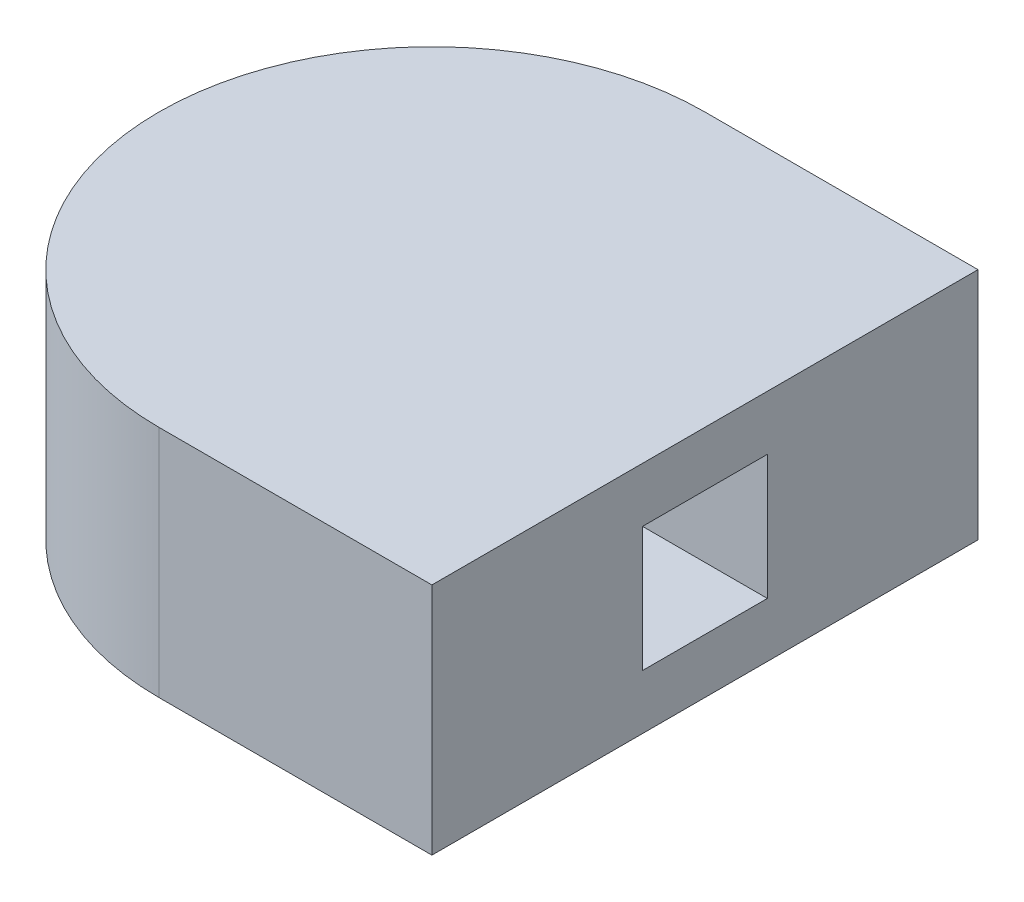
ISO-10303-21;
HEADER;
FILE_DESCRIPTION(('STEP AP214'),'2;1');
FILE_NAME('part.step','',(''),(''),'','','');
FILE_SCHEMA(('AUTOMOTIVE_DESIGN { 1 0 10303 214 1 1 1 1 }'));
ENDSEC;
DATA;
#1=APPLICATION_CONTEXT('core data for automotive mechanical design processes');
#2=APPLICATION_PROTOCOL_DEFINITION('international standard','automotive_design',2000,#1);
#3=PRODUCT_CONTEXT('',#1,'mechanical');
#4=PRODUCT('Part','Part','',(#3));
#5=PRODUCT_RELATED_PRODUCT_CATEGORY('part','',(#4));
#6=PRODUCT_DEFINITION_FORMATION('','',#4);
#7=PRODUCT_DEFINITION_CONTEXT('part definition',#1,'design');
#8=PRODUCT_DEFINITION('design','',#6,#7);
#9=PRODUCT_DEFINITION_SHAPE('','',#8);
#10=(LENGTH_UNIT() NAMED_UNIT(*) SI_UNIT(.MILLI.,.METRE.));
#11=(NAMED_UNIT(*) PLANE_ANGLE_UNIT() SI_UNIT($,.RADIAN.));
#12=(NAMED_UNIT(*) SI_UNIT($,.STERADIAN.) SOLID_ANGLE_UNIT());
#13=UNCERTAINTY_MEASURE_WITH_UNIT(LENGTH_MEASURE(1.E-05),#10,'distance_accuracy_value','');
#14=(GEOMETRIC_REPRESENTATION_CONTEXT(3) GLOBAL_UNCERTAINTY_ASSIGNED_CONTEXT((#13)) GLOBAL_UNIT_ASSIGNED_CONTEXT((#10,
#11,#12)) REPRESENTATION_CONTEXT('',''));
#15=CARTESIAN_POINT('',(0.,0.,0.));
#16=DIRECTION('',(0.,0.,1.));
#17=DIRECTION('',(1.,0.,0.));
#18=AXIS2_PLACEMENT_3D('',#15,#16,#17);
#19=CARTESIAN_POINT('',(22.225,19.05,-22.225));
#20=DIRECTION('',(0.,-1.,0.));
#21=DIRECTION('',(0.,0.,-1.));
#22=AXIS2_PLACEMENT_3D('',#19,#20,#21);
#23=CYLINDRICAL_SURFACE('',#22,22.225);
#24=CARTESIAN_POINT('',(22.225,0.,-22.225));
#25=DIRECTION('',(0.,1.,0.));
#26=DIRECTION('',(0.,0.,1.));
#27=AXIS2_PLACEMENT_3D('',#24,#25,#26);
#28=CIRCLE('',#27,22.225);
#29=CARTESIAN_POINT('',(22.225,0.,-44.45));
#30=VERTEX_POINT('',#29);
#31=CARTESIAN_POINT('',(22.225,0.,0.));
#32=VERTEX_POINT('',#31);
#33=EDGE_CURVE('E145',#30,#32,#28,.T.);
#34=ORIENTED_EDGE('',*,*,#33,.T.);
#35=DIRECTION('',(0.,-1.,0.));
#36=VECTOR('',#35,1.);
#37=CARTESIAN_POINT('',(22.225,19.05,0.));
#38=LINE('',#37,#36);
#39=CARTESIAN_POINT('',(22.225,19.05,0.));
#40=VERTEX_POINT('',#39);
#41=EDGE_CURVE('E11',#40,#32,#38,.T.);
#42=ORIENTED_EDGE('',*,*,#41,.F.);
#43=CARTESIAN_POINT('',(22.225,19.05,-22.225));
#44=DIRECTION('',(0.,1.,0.));
#45=DIRECTION('',(0.,0.,1.));
#46=AXIS2_PLACEMENT_3D('',#43,#44,#45);
#47=CIRCLE('',#46,22.225);
#48=CARTESIAN_POINT('',(22.225,19.05,-44.45));
#49=VERTEX_POINT('',#48);
#50=EDGE_CURVE('E149',#49,#40,#47,.T.);
#51=ORIENTED_EDGE('',*,*,#50,.F.);
#52=DIRECTION('',(0.,-1.,0.));
#53=VECTOR('',#52,1.);
#54=CARTESIAN_POINT('',(22.225,19.05,-44.45));
#55=LINE('',#54,#53);
#56=EDGE_CURVE('E61',#49,#30,#55,.T.);
#57=ORIENTED_EDGE('',*,*,#56,.T.);
#58=EDGE_LOOP('',(#34,#42,#51,#57));
#59=FACE_BOUND('',#58,.T.);
#60=ADVANCED_FACE('F38',(#59),#23,.T.);
#61=CARTESIAN_POINT('',(0.,19.05,0.));
#62=DIRECTION('',(0.,0.,-1.));
#63=DIRECTION('',(-1.,0.,0.));
#64=AXIS2_PLACEMENT_3D('',#61,#62,#63);
#65=PLANE('',#64);
#66=DIRECTION('',(1.,0.,0.));
#67=VECTOR('',#66,1.);
#68=CARTESIAN_POINT('',(0.,0.,0.));
#69=LINE('',#68,#67);
#70=CARTESIAN_POINT('',(44.45,0.,0.));
#71=VERTEX_POINT('',#70);
#72=EDGE_CURVE('E158',#32,#71,#69,.T.);
#73=ORIENTED_EDGE('',*,*,#72,.T.);
#74=DIRECTION('',(0.,-1.,0.));
#75=VECTOR('',#74,1.);
#76=CARTESIAN_POINT('',(44.45,19.05,0.));
#77=LINE('',#76,#75);
#78=CARTESIAN_POINT('',(44.45,19.05,0.));
#79=VERTEX_POINT('',#78);
#80=EDGE_CURVE('E45',#79,#71,#77,.T.);
#81=ORIENTED_EDGE('',*,*,#80,.F.);
#82=DIRECTION('',(1.,0.,0.));
#83=VECTOR('',#82,1.);
#84=CARTESIAN_POINT('',(0.,19.05,0.));
#85=LINE('',#84,#83);
#86=EDGE_CURVE('E87',#40,#79,#85,.T.);
#87=ORIENTED_EDGE('',*,*,#86,.F.);
#88=ORIENTED_EDGE('',*,*,#41,.T.);
#89=EDGE_LOOP('',(#73,#81,#87,#88));
#90=FACE_BOUND('',#89,.T.);
#91=ADVANCED_FACE('F180',(#90),#65,.F.);
#92=CARTESIAN_POINT('',(44.45,19.05,0.));
#93=DIRECTION('',(-1.,0.,0.));
#94=DIRECTION('',(0.,0.,1.));
#95=AXIS2_PLACEMENT_3D('',#92,#93,#94);
#96=PLANE('',#95);
#97=DIRECTION('',(0.,0.,1.));
#98=VECTOR('',#97,1.);
#99=CARTESIAN_POINT('',(44.45,14.605,-17.145));
#100=LINE('',#99,#98);
#101=CARTESIAN_POINT('',(44.45,14.605,-27.305));
#102=VERTEX_POINT('',#101);
#103=CARTESIAN_POINT('',(44.45,14.605,-17.145));
#104=VERTEX_POINT('',#103);
#105=EDGE_CURVE('E139',#102,#104,#100,.T.);
#106=ORIENTED_EDGE('',*,*,#105,.F.);
#107=DIRECTION('',(0.,1.,0.));
#108=VECTOR('',#107,1.);
#109=CARTESIAN_POINT('',(44.45,14.605,-27.305));
#110=LINE('',#109,#108);
#111=CARTESIAN_POINT('',(44.45,4.445,-27.305));
#112=VERTEX_POINT('',#111);
#113=EDGE_CURVE('E52',#112,#102,#110,.T.);
#114=ORIENTED_EDGE('',*,*,#113,.F.);
#115=DIRECTION('',(0.,0.,-1.));
#116=VECTOR('',#115,1.);
#117=CARTESIAN_POINT('',(44.45,4.445,-17.145));
#118=LINE('',#117,#116);
#119=CARTESIAN_POINT('',(44.45,4.445,-17.145));
#120=VERTEX_POINT('',#119);
#121=EDGE_CURVE('E130',#120,#112,#118,.T.);
#122=ORIENTED_EDGE('',*,*,#121,.F.);
#123=DIRECTION('',(0.,-1.,0.));
#124=VECTOR('',#123,1.);
#125=CARTESIAN_POINT('',(44.45,14.605,-17.145));
#126=LINE('',#125,#124);
#127=EDGE_CURVE('E133',#104,#120,#126,.T.);
#128=ORIENTED_EDGE('',*,*,#127,.F.);
#129=EDGE_LOOP('',(#106,#114,#122,#128));
#130=FACE_BOUND('',#129,.T.);
#131=DIRECTION('',(0.,0.,-1.));
#132=VECTOR('',#131,1.);
#133=CARTESIAN_POINT('',(44.45,0.,0.));
#134=LINE('',#133,#132);
#135=CARTESIAN_POINT('',(44.45,0.,-44.45));
#136=VERTEX_POINT('',#135);
#137=EDGE_CURVE('E160',#71,#136,#134,.T.);
#138=ORIENTED_EDGE('',*,*,#137,.T.);
#139=DIRECTION('',(0.,-1.,0.));
#140=VECTOR('',#139,1.);
#141=CARTESIAN_POINT('',(44.45,19.05,-44.45));
#142=LINE('',#141,#140);
#143=CARTESIAN_POINT('',(44.45,19.05,-44.45));
#144=VERTEX_POINT('',#143);
#145=EDGE_CURVE('E166',#144,#136,#142,.T.);
#146=ORIENTED_EDGE('',*,*,#145,.F.);
#147=DIRECTION('',(0.,0.,-1.));
#148=VECTOR('',#147,1.);
#149=CARTESIAN_POINT('',(44.45,19.05,0.));
#150=LINE('',#149,#148);
#151=EDGE_CURVE('E153',#79,#144,#150,.T.);
#152=ORIENTED_EDGE('',*,*,#151,.F.);
#153=ORIENTED_EDGE('',*,*,#80,.T.);
#154=EDGE_LOOP('',(#138,#146,#152,#153));
#155=FACE_BOUND('',#154,.T.);
#156=ADVANCED_FACE('F171',(#130,#155),#96,.F.);
#157=CARTESIAN_POINT('',(0.,19.05,-44.45));
#158=DIRECTION('',(0.,0.,-1.));
#159=DIRECTION('',(-1.,0.,0.));
#160=AXIS2_PLACEMENT_3D('',#157,#158,#159);
#161=PLANE('',#160);
#162=DIRECTION('',(1.,0.,0.));
#163=VECTOR('',#162,1.);
#164=CARTESIAN_POINT('',(0.,0.,-44.45));
#165=LINE('',#164,#163);
#166=EDGE_CURVE('E151',#30,#136,#165,.T.);
#167=ORIENTED_EDGE('',*,*,#166,.F.);
#168=ORIENTED_EDGE('',*,*,#56,.F.);
#169=DIRECTION('',(1.,0.,0.));
#170=VECTOR('',#169,1.);
#171=CARTESIAN_POINT('',(0.,19.05,-44.45));
#172=LINE('',#171,#170);
#173=EDGE_CURVE('E155',#49,#144,#172,.T.);
#174=ORIENTED_EDGE('',*,*,#173,.T.);
#175=ORIENTED_EDGE('',*,*,#145,.T.);
#176=EDGE_LOOP('',(#167,#168,#174,#175));
#177=FACE_BOUND('',#176,.T.);
#178=ADVANCED_FACE('F175',(#177),#161,.T.);
#179=CARTESIAN_POINT('',(0.,19.05,0.));
#180=DIRECTION('',(0.,1.,0.));
#181=DIRECTION('',(0.,0.,1.));
#182=AXIS2_PLACEMENT_3D('',#179,#180,#181);
#183=PLANE('',#182);
#184=ORIENTED_EDGE('',*,*,#50,.T.);
#185=ORIENTED_EDGE('',*,*,#86,.T.);
#186=ORIENTED_EDGE('',*,*,#151,.T.);
#187=ORIENTED_EDGE('',*,*,#173,.F.);
#188=EDGE_LOOP('',(#184,#185,#186,#187));
#189=FACE_BOUND('',#188,.T.);
#190=ADVANCED_FACE('F178',(#189),#183,.T.);
#191=CARTESIAN_POINT('',(0.,0.,0.));
#192=DIRECTION('',(0.,1.,0.));
#193=DIRECTION('',(0.,0.,1.));
#194=AXIS2_PLACEMENT_3D('',#191,#192,#193);
#195=PLANE('',#194);
#196=ORIENTED_EDGE('',*,*,#33,.F.);
#197=ORIENTED_EDGE('',*,*,#166,.T.);
#198=ORIENTED_EDGE('',*,*,#137,.F.);
#199=ORIENTED_EDGE('',*,*,#72,.F.);
#200=EDGE_LOOP('',(#196,#197,#198,#199));
#201=FACE_BOUND('',#200,.T.);
#202=ADVANCED_FACE('F174',(#201),#195,.F.);
#203=CARTESIAN_POINT('',(29.21,14.605,-27.305));
#204=DIRECTION('',(0.,0.,-1.));
#205=DIRECTION('',(-1.,0.,0.));
#206=AXIS2_PLACEMENT_3D('',#203,#204,#205);
#207=PLANE('',#206);
#208=ORIENTED_EDGE('',*,*,#113,.T.);
#209=DIRECTION('',(1.,0.,0.));
#210=VECTOR('',#209,1.);
#211=CARTESIAN_POINT('',(29.21,14.605,-27.305));
#212=LINE('',#211,#210);
#213=CARTESIAN_POINT('',(29.21,14.605,-27.305));
#214=VERTEX_POINT('',#213);
#215=EDGE_CURVE('E108',#214,#102,#212,.T.);
#216=ORIENTED_EDGE('',*,*,#215,.F.);
#217=DIRECTION('',(0.,1.,0.));
#218=VECTOR('',#217,1.);
#219=CARTESIAN_POINT('',(29.21,14.605,-27.305));
#220=LINE('',#219,#218);
#221=CARTESIAN_POINT('',(29.21,4.445,-27.305));
#222=VERTEX_POINT('',#221);
#223=EDGE_CURVE('E112',#222,#214,#220,.T.);
#224=ORIENTED_EDGE('',*,*,#223,.F.);
#225=DIRECTION('',(1.,0.,0.));
#226=VECTOR('',#225,1.);
#227=CARTESIAN_POINT('',(29.21,4.445,-27.305));
#228=LINE('',#227,#226);
#229=EDGE_CURVE('E143',#222,#112,#228,.T.);
#230=ORIENTED_EDGE('',*,*,#229,.T.);
#231=EDGE_LOOP('',(#208,#216,#224,#230));
#232=FACE_BOUND('',#231,.T.);
#233=ADVANCED_FACE('F110',(#232),#207,.F.);
#234=CARTESIAN_POINT('',(29.21,4.445,-17.145));
#235=DIRECTION('',(0.,-1.,0.));
#236=DIRECTION('',(0.,0.,-1.));
#237=AXIS2_PLACEMENT_3D('',#234,#235,#236);
#238=PLANE('',#237);
#239=ORIENTED_EDGE('',*,*,#121,.T.);
#240=ORIENTED_EDGE('',*,*,#229,.F.);
#241=DIRECTION('',(0.,0.,-1.));
#242=VECTOR('',#241,1.);
#243=CARTESIAN_POINT('',(29.21,4.445,-17.145));
#244=LINE('',#243,#242);
#245=CARTESIAN_POINT('',(29.21,4.445,-17.145));
#246=VERTEX_POINT('',#245);
#247=EDGE_CURVE('E118',#246,#222,#244,.T.);
#248=ORIENTED_EDGE('',*,*,#247,.F.);
#249=DIRECTION('',(1.,0.,0.));
#250=VECTOR('',#249,1.);
#251=CARTESIAN_POINT('',(29.21,4.445,-17.145));
#252=LINE('',#251,#250);
#253=EDGE_CURVE('E146',#246,#120,#252,.T.);
#254=ORIENTED_EDGE('',*,*,#253,.T.);
#255=EDGE_LOOP('',(#239,#240,#248,#254));
#256=FACE_BOUND('',#255,.T.);
#257=ADVANCED_FACE('F198',(#256),#238,.F.);
#258=CARTESIAN_POINT('',(29.21,14.605,-17.145));
#259=DIRECTION('',(0.,0.,1.));
#260=DIRECTION('',(1.,0.,0.));
#261=AXIS2_PLACEMENT_3D('',#258,#259,#260);
#262=PLANE('',#261);
#263=ORIENTED_EDGE('',*,*,#127,.T.);
#264=ORIENTED_EDGE('',*,*,#253,.F.);
#265=DIRECTION('',(0.,-1.,0.));
#266=VECTOR('',#265,1.);
#267=CARTESIAN_POINT('',(29.21,14.605,-17.145));
#268=LINE('',#267,#266);
#269=CARTESIAN_POINT('',(29.21,14.605,-17.145));
#270=VERTEX_POINT('',#269);
#271=EDGE_CURVE('E126',#270,#246,#268,.T.);
#272=ORIENTED_EDGE('',*,*,#271,.F.);
#273=DIRECTION('',(1.,0.,0.));
#274=VECTOR('',#273,1.);
#275=CARTESIAN_POINT('',(29.21,14.605,-17.145));
#276=LINE('',#275,#274);
#277=EDGE_CURVE('E117',#270,#104,#276,.T.);
#278=ORIENTED_EDGE('',*,*,#277,.T.);
#279=EDGE_LOOP('',(#263,#264,#272,#278));
#280=FACE_BOUND('',#279,.T.);
#281=ADVANCED_FACE('F201',(#280),#262,.F.);
#282=CARTESIAN_POINT('',(29.21,14.605,-17.145));
#283=DIRECTION('',(0.,1.,0.));
#284=DIRECTION('',(0.,0.,1.));
#285=AXIS2_PLACEMENT_3D('',#282,#283,#284);
#286=PLANE('',#285);
#287=ORIENTED_EDGE('',*,*,#105,.T.);
#288=ORIENTED_EDGE('',*,*,#277,.F.);
#289=DIRECTION('',(0.,0.,1.));
#290=VECTOR('',#289,1.);
#291=CARTESIAN_POINT('',(29.21,14.605,-17.145));
#292=LINE('',#291,#290);
#293=EDGE_CURVE('E121',#214,#270,#292,.T.);
#294=ORIENTED_EDGE('',*,*,#293,.F.);
#295=ORIENTED_EDGE('',*,*,#215,.T.);
#296=EDGE_LOOP('',(#287,#288,#294,#295));
#297=FACE_BOUND('',#296,.T.);
#298=ADVANCED_FACE('F122',(#297),#286,.F.);
#299=CARTESIAN_POINT('',(29.21,0.,0.));
#300=DIRECTION('',(1.,0.,0.));
#301=DIRECTION('',(0.,0.,-1.));
#302=AXIS2_PLACEMENT_3D('',#299,#300,#301);
#303=PLANE('',#302);
#304=ORIENTED_EDGE('',*,*,#223,.T.);
#305=ORIENTED_EDGE('',*,*,#293,.T.);
#306=ORIENTED_EDGE('',*,*,#271,.T.);
#307=ORIENTED_EDGE('',*,*,#247,.T.);
#308=EDGE_LOOP('',(#304,#305,#306,#307));
#309=FACE_BOUND('',#308,.T.);
#310=ADVANCED_FACE('F128',(#309),#303,.T.);
#311=CLOSED_SHELL('',(#60,#91,#156,#178,#190,#202,#233,#257,#281,#298,#310));
#312=MANIFOLD_SOLID_BREP('B2',#311);
#313=ADVANCED_BREP_SHAPE_REPRESENTATION('',(#18,#312),#14);
#314=SHAPE_DEFINITION_REPRESENTATION(#9,#313);
ENDSEC;
END-ISO-10303-21;
